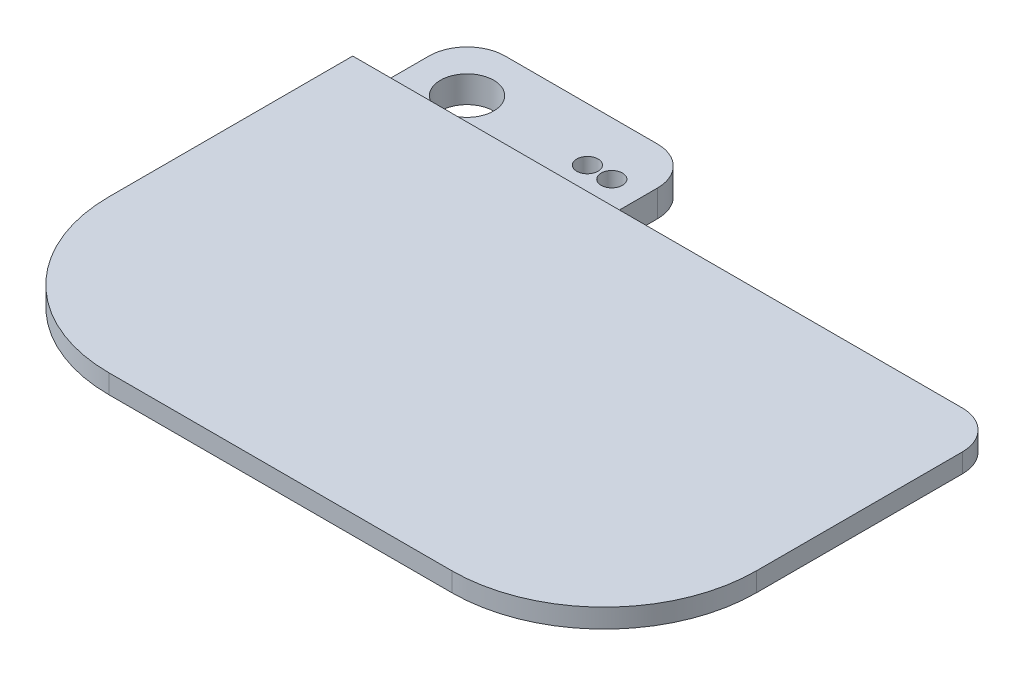
ISO-10303-21;
HEADER;
FILE_DESCRIPTION(('STEP AP214'),'2;1');
FILE_NAME('part.step','',(''),(''),'','','');
FILE_SCHEMA(('AUTOMOTIVE_DESIGN { 1 0 10303 214 1 1 1 1 }'));
ENDSEC;
DATA;
#1=APPLICATION_CONTEXT('core data for automotive mechanical design processes');
#2=APPLICATION_PROTOCOL_DEFINITION('international standard','automotive_design',2000,#1);
#3=PRODUCT_CONTEXT('',#1,'mechanical');
#4=PRODUCT('Part','Part','',(#3));
#5=PRODUCT_RELATED_PRODUCT_CATEGORY('part','',(#4));
#6=PRODUCT_DEFINITION_FORMATION('','',#4);
#7=PRODUCT_DEFINITION_CONTEXT('part definition',#1,'design');
#8=PRODUCT_DEFINITION('design','',#6,#7);
#9=PRODUCT_DEFINITION_SHAPE('','',#8);
#10=(LENGTH_UNIT() NAMED_UNIT(*) SI_UNIT(.MILLI.,.METRE.));
#11=(NAMED_UNIT(*) PLANE_ANGLE_UNIT() SI_UNIT($,.RADIAN.));
#12=(NAMED_UNIT(*) SI_UNIT($,.STERADIAN.) SOLID_ANGLE_UNIT());
#13=UNCERTAINTY_MEASURE_WITH_UNIT(LENGTH_MEASURE(1.E-05),#10,'distance_accuracy_value','');
#14=(GEOMETRIC_REPRESENTATION_CONTEXT(3) GLOBAL_UNCERTAINTY_ASSIGNED_CONTEXT((#13)) GLOBAL_UNIT_ASSIGNED_CONTEXT((#10,
#11,#12)) REPRESENTATION_CONTEXT('',''));
#15=CARTESIAN_POINT('',(0.,0.,0.));
#16=DIRECTION('',(0.,0.,1.));
#17=DIRECTION('',(1.,0.,0.));
#18=AXIS2_PLACEMENT_3D('',#15,#16,#17);
#19=CARTESIAN_POINT('',(107.95,3.175,-66.04));
#20=DIRECTION('',(0.,0.,1.));
#21=DIRECTION('',(1.,0.,0.));
#22=AXIS2_PLACEMENT_3D('',#19,#20,#21);
#23=PLANE('',#22);
#24=DIRECTION('',(0.,-1.,0.));
#25=VECTOR('',#24,1.);
#26=CARTESIAN_POINT('',(88.9,3.175,-66.04));
#27=LINE('',#26,#25);
#28=CARTESIAN_POINT('',(88.9,-3.175,-66.04));
#29=VERTEX_POINT('',#28);
#30=CARTESIAN_POINT('',(88.9,-4.445,-66.04));
#31=VERTEX_POINT('',#30);
#32=EDGE_CURVE('E250',#29,#31,#27,.T.);
#33=ORIENTED_EDGE('',*,*,#32,.T.);
#34=CARTESIAN_POINT('',(85.725,-4.445,-66.04));
#35=DIRECTION('',(0.,0.,1.));
#36=DIRECTION('',(1.,0.,0.));
#37=AXIS2_PLACEMENT_3D('',#34,#35,#36);
#38=CIRCLE('',#37,3.175);
#39=CARTESIAN_POINT('',(85.725,-7.62,-66.04));
#40=VERTEX_POINT('',#39);
#41=EDGE_CURVE('E55',#31,#40,#38,.F.);
#42=ORIENTED_EDGE('',*,*,#41,.T.);
#43=DIRECTION('',(-1.,0.,0.));
#44=VECTOR('',#43,1.);
#45=CARTESIAN_POINT('',(107.95,-7.62,-66.04));
#46=LINE('',#45,#44);
#47=CARTESIAN_POINT('',(38.1,-7.62,-66.04));
#48=VERTEX_POINT('',#47);
#49=EDGE_CURVE('E205',#40,#48,#46,.T.);
#50=ORIENTED_EDGE('',*,*,#49,.T.);
#51=DIRECTION('',(0.,-1.,0.));
#52=VECTOR('',#51,1.);
#53=CARTESIAN_POINT('',(38.1,3.175,-66.04));
#54=LINE('',#53,#52);
#55=CARTESIAN_POINT('',(38.1,3.175,-66.04));
#56=VERTEX_POINT('',#55);
#57=EDGE_CURVE('E208',#56,#48,#54,.T.);
#58=ORIENTED_EDGE('',*,*,#57,.F.);
#59=DIRECTION('',(-1.,0.,0.));
#60=VECTOR('',#59,1.);
#61=CARTESIAN_POINT('',(107.95,3.175,-66.04));
#62=LINE('',#61,#60);
#63=CARTESIAN_POINT('',(101.6,3.175,-66.04));
#64=VERTEX_POINT('',#63);
#65=EDGE_CURVE('E206',#64,#56,#62,.T.);
#66=ORIENTED_EDGE('',*,*,#65,.F.);
#67=DIRECTION('',(0.,-1.,0.));
#68=VECTOR('',#67,1.);
#69=CARTESIAN_POINT('',(101.6,3.175,-66.04));
#70=LINE('',#69,#68);
#71=CARTESIAN_POINT('',(101.6,0.,-66.04));
#72=VERTEX_POINT('',#71);
#73=EDGE_CURVE('E287',#64,#72,#70,.T.);
#74=ORIENTED_EDGE('',*,*,#73,.T.);
#75=DIRECTION('',(-1.,0.,0.));
#76=VECTOR('',#75,1.);
#77=CARTESIAN_POINT('',(107.95,0.,-66.04));
#78=LINE('',#77,#76);
#79=CARTESIAN_POINT('',(92.075,0.,-66.04));
#80=VERTEX_POINT('',#79);
#81=EDGE_CURVE('E240',#72,#80,#78,.T.);
#82=ORIENTED_EDGE('',*,*,#81,.T.);
#83=CARTESIAN_POINT('',(92.075,-3.175,-66.04));
#84=DIRECTION('',(0.,0.,1.));
#85=DIRECTION('',(1.,0.,0.));
#86=AXIS2_PLACEMENT_3D('',#83,#84,#85);
#87=CIRCLE('',#86,3.175);
#88=EDGE_CURVE('E11',#80,#29,#87,.T.);
#89=ORIENTED_EDGE('',*,*,#88,.T.);
#90=EDGE_LOOP('',(#33,#42,#50,#58,#66,#74,#82,#89));
#91=FACE_BOUND('',#90,.T.);
#92=ADVANCED_FACE('F32',(#91),#23,.F.);
#93=CARTESIAN_POINT('',(0.,3.175,-85.09));
#94=DIRECTION('',(0.,0.,1.));
#95=DIRECTION('',(1.,0.,0.));
#96=AXIS2_PLACEMENT_3D('',#93,#94,#95);
#97=PLANE('',#96);
#98=DIRECTION('',(1.,0.,0.));
#99=VECTOR('',#98,1.);
#100=CARTESIAN_POINT('',(0.,-7.62,-85.09));
#101=LINE('',#100,#99);
#102=CARTESIAN_POINT('',(6.35,-7.62,-85.09));
#103=VERTEX_POINT('',#102);
#104=CARTESIAN_POINT('',(31.75,-7.62,-85.09));
#105=VERTEX_POINT('',#104);
#106=EDGE_CURVE('E220',#103,#105,#101,.T.);
#107=ORIENTED_EDGE('',*,*,#106,.F.);
#108=DIRECTION('',(0.,-1.,0.));
#109=VECTOR('',#108,1.);
#110=CARTESIAN_POINT('',(6.35,3.175,-85.09));
#111=LINE('',#110,#109);
#112=CARTESIAN_POINT('',(6.35000000000002,-3.175,-85.09));
#113=VERTEX_POINT('',#112);
#114=EDGE_CURVE('E280',#103,#113,#111,.F.);
#115=ORIENTED_EDGE('',*,*,#114,.T.);
#116=DIRECTION('',(-1.,0.,0.));
#117=VECTOR('',#116,1.);
#118=CARTESIAN_POINT('',(38.1,-3.175,-85.09));
#119=LINE('',#118,#117);
#120=CARTESIAN_POINT('',(31.75,-3.175,-85.09));
#121=VERTEX_POINT('',#120);
#122=EDGE_CURVE('E167',#121,#113,#119,.T.);
#123=ORIENTED_EDGE('',*,*,#122,.F.);
#124=DIRECTION('',(0.,-1.,0.));
#125=VECTOR('',#124,1.);
#126=CARTESIAN_POINT('',(31.75,3.175,-85.09));
#127=LINE('',#126,#125);
#128=EDGE_CURVE('E277',#121,#105,#127,.T.);
#129=ORIENTED_EDGE('',*,*,#128,.T.);
#130=EDGE_LOOP('',(#107,#115,#123,#129));
#131=FACE_BOUND('',#130,.T.);
#132=ADVANCED_FACE('F369',(#131),#97,.F.);
#133=CARTESIAN_POINT('',(8.89,3.175,-76.2));
#134=DIRECTION('',(0.,-1.,0.));
#135=DIRECTION('',(0.,0.,-1.));
#136=AXIS2_PLACEMENT_3D('',#133,#134,#135);
#137=CYLINDRICAL_SURFACE('',#136,4.445);
#138=CARTESIAN_POINT('',(8.89,-7.62,-76.2));
#139=DIRECTION('',(0.,-1.,0.));
#140=DIRECTION('',(0.,0.,-1.));
#141=AXIS2_PLACEMENT_3D('',#138,#139,#140);
#142=CIRCLE('',#141,4.445);
#143=CARTESIAN_POINT('',(8.89,-7.62,-80.645));
#144=VERTEX_POINT('',#143);
#145=EDGE_CURVE('E213',#144,#144,#142,.T.);
#146=ORIENTED_EDGE('',*,*,#145,.T.);
#147=EDGE_LOOP('',(#146));
#148=FACE_BOUND('',#147,.T.);
#149=CARTESIAN_POINT('',(8.89,-3.175,-76.2));
#150=DIRECTION('',(0.,1.,0.));
#151=DIRECTION('',(0.,0.,1.));
#152=AXIS2_PLACEMENT_3D('',#149,#150,#151);
#153=CIRCLE('',#152,4.445);
#154=CARTESIAN_POINT('',(8.89,-3.175,-71.755));
#155=VERTEX_POINT('',#154);
#156=EDGE_CURVE('E202',#155,#155,#153,.T.);
#157=ORIENTED_EDGE('',*,*,#156,.T.);
#158=EDGE_LOOP('',(#157));
#159=FACE_BOUND('',#158,.T.);
#160=ADVANCED_FACE('F374',(#148,#159),#137,.F.);
#161=CARTESIAN_POINT('',(38.1,3.175,-85.09));
#162=DIRECTION('',(-1.,0.,0.));
#163=DIRECTION('',(0.,0.,1.));
#164=AXIS2_PLACEMENT_3D('',#161,#162,#163);
#165=PLANE('',#164);
#166=DIRECTION('',(0.,0.,-1.));
#167=VECTOR('',#166,1.);
#168=CARTESIAN_POINT('',(38.1,-7.62,-85.09));
#169=LINE('',#168,#167);
#170=CARTESIAN_POINT('',(38.1,-7.62,-78.74));
#171=VERTEX_POINT('',#170);
#172=EDGE_CURVE('E209',#48,#171,#169,.T.);
#173=ORIENTED_EDGE('',*,*,#172,.T.);
#174=DIRECTION('',(0.,-1.,0.));
#175=VECTOR('',#174,1.);
#176=CARTESIAN_POINT('',(38.1,3.175,-78.74));
#177=LINE('',#176,#175);
#178=CARTESIAN_POINT('',(38.1,-3.175,-78.74));
#179=VERTEX_POINT('',#178);
#180=EDGE_CURVE('E164',#171,#179,#177,.F.);
#181=ORIENTED_EDGE('',*,*,#180,.T.);
#182=DIRECTION('',(0.,0.,-1.));
#183=VECTOR('',#182,1.);
#184=CARTESIAN_POINT('',(38.1,-3.175,-66.04));
#185=LINE('',#184,#183);
#186=CARTESIAN_POINT('',(38.1,-3.175,-71.12));
#187=VERTEX_POINT('',#186);
#188=EDGE_CURVE('E155',#187,#179,#185,.T.);
#189=ORIENTED_EDGE('',*,*,#188,.F.);
#190=DIRECTION('',(0.,0.78086880944303,0.624695047554424));
#191=VECTOR('',#190,1.);
#192=CARTESIAN_POINT('',(38.1,3.175,-66.04));
#193=LINE('',#192,#191);
#194=EDGE_CURVE('E161',#187,#56,#193,.T.);
#195=ORIENTED_EDGE('',*,*,#194,.T.);
#196=ORIENTED_EDGE('',*,*,#57,.T.);
#197=EDGE_LOOP('',(#173,#181,#189,#195,#196));
#198=FACE_BOUND('',#197,.T.);
#199=ADVANCED_FACE('F158',(#198),#165,.F.);
#200=CARTESIAN_POINT('',(0.,3.175,0.));
#201=DIRECTION('',(0.,-1.,0.));
#202=DIRECTION('',(0.,0.,-1.));
#203=AXIS2_PLACEMENT_3D('',#200,#201,#202);
#204=PLANE('',#203);
#205=DIRECTION('',(0.,0.,-1.));
#206=VECTOR('',#205,1.);
#207=CARTESIAN_POINT('',(107.95,3.175,0.));
#208=LINE('',#207,#206);
#209=CARTESIAN_POINT('',(107.95,3.175,-25.4));
#210=VERTEX_POINT('',#209);
#211=CARTESIAN_POINT('',(107.95,3.175,-59.69));
#212=VERTEX_POINT('',#211);
#213=EDGE_CURVE('E237',#210,#212,#208,.T.);
#214=ORIENTED_EDGE('',*,*,#213,.T.);
#215=CARTESIAN_POINT('',(101.6,3.175,-59.69));
#216=DIRECTION('',(0.,-1.,0.));
#217=DIRECTION('',(0.,0.,-1.));
#218=AXIS2_PLACEMENT_3D('',#215,#216,#217);
#219=CIRCLE('',#218,6.35);
#220=EDGE_CURVE('E294',#212,#64,#219,.F.);
#221=ORIENTED_EDGE('',*,*,#220,.T.);
#222=ORIENTED_EDGE('',*,*,#65,.T.);
#223=DIRECTION('',(-1.,0.,0.));
#224=VECTOR('',#223,1.);
#225=CARTESIAN_POINT('',(46.2319677815397,3.175,-66.04));
#226=LINE('',#225,#224);
#227=CARTESIAN_POINT('',(0.,3.175,-66.04));
#228=VERTEX_POINT('',#227);
#229=EDGE_CURVE('E180',#56,#228,#226,.T.);
#230=ORIENTED_EDGE('',*,*,#229,.T.);
#231=DIRECTION('',(0.,0.,1.));
#232=VECTOR('',#231,1.);
#233=CARTESIAN_POINT('',(0.,3.175,0.));
#234=LINE('',#233,#232);
#235=CARTESIAN_POINT('',(0.,3.175,-25.4));
#236=VERTEX_POINT('',#235);
#237=EDGE_CURVE('E230',#228,#236,#234,.T.);
#238=ORIENTED_EDGE('',*,*,#237,.T.);
#239=CARTESIAN_POINT('',(25.4,3.175,-25.4));
#240=DIRECTION('',(0.,-1.,0.));
#241=DIRECTION('',(0.,0.,-1.));
#242=AXIS2_PLACEMENT_3D('',#239,#240,#241);
#243=CIRCLE('',#242,25.4);
#244=CARTESIAN_POINT('',(25.4,3.175,0.));
#245=VERTEX_POINT('',#244);
#246=EDGE_CURVE('E265',#236,#245,#243,.F.);
#247=ORIENTED_EDGE('',*,*,#246,.T.);
#248=DIRECTION('',(1.,0.,0.));
#249=VECTOR('',#248,1.);
#250=CARTESIAN_POINT('',(0.,3.175,0.));
#251=LINE('',#250,#249);
#252=CARTESIAN_POINT('',(82.55,3.175,0.));
#253=VERTEX_POINT('',#252);
#254=EDGE_CURVE('E233',#245,#253,#251,.T.);
#255=ORIENTED_EDGE('',*,*,#254,.T.);
#256=CARTESIAN_POINT('',(82.55,3.175,-25.4));
#257=DIRECTION('',(0.,-1.,0.));
#258=DIRECTION('',(0.,0.,-1.));
#259=AXIS2_PLACEMENT_3D('',#256,#257,#258);
#260=CIRCLE('',#259,25.4);
#261=EDGE_CURVE('E263',#253,#210,#260,.F.);
#262=ORIENTED_EDGE('',*,*,#261,.T.);
#263=EDGE_LOOP('',(#214,#221,#222,#230,#238,#247,#255,#262));
#264=FACE_BOUND('',#263,.T.);
#265=ADVANCED_FACE('F388',(#264),#204,.F.);
#266=CARTESIAN_POINT('',(0.,0.,0.));
#267=DIRECTION('',(0.,-1.,0.));
#268=DIRECTION('',(0.,0.,-1.));
#269=AXIS2_PLACEMENT_3D('',#266,#267,#268);
#270=PLANE('',#269);
#271=DIRECTION('',(-1.,0.,0.));
#272=VECTOR('',#271,1.);
#273=CARTESIAN_POINT('',(0.,0.,-59.69));
#274=LINE('',#273,#272);
#275=CARTESIAN_POINT('',(92.075,0.,-59.69));
#276=VERTEX_POINT('',#275);
#277=CARTESIAN_POINT('',(0.,0.,-59.69));
#278=VERTEX_POINT('',#277);
#279=EDGE_CURVE('E216',#276,#278,#274,.T.);
#280=ORIENTED_EDGE('',*,*,#279,.F.);
#281=DIRECTION('',(0.,0.,1.));
#282=VECTOR('',#281,1.);
#283=CARTESIAN_POINT('',(92.075,0.,0.));
#284=LINE('',#283,#282);
#285=EDGE_CURVE('E301',#276,#80,#284,.F.);
#286=ORIENTED_EDGE('',*,*,#285,.T.);
#287=ORIENTED_EDGE('',*,*,#81,.F.);
#288=CARTESIAN_POINT('',(101.6,0.,-59.69));
#289=DIRECTION('',(0.,-1.,0.));
#290=DIRECTION('',(0.,0.,-1.));
#291=AXIS2_PLACEMENT_3D('',#288,#289,#290);
#292=CIRCLE('',#291,6.35);
#293=CARTESIAN_POINT('',(107.95,0.,-59.69));
#294=VERTEX_POINT('',#293);
#295=EDGE_CURVE('E290',#72,#294,#292,.T.);
#296=ORIENTED_EDGE('',*,*,#295,.T.);
#297=DIRECTION('',(0.,0.,-1.));
#298=VECTOR('',#297,1.);
#299=CARTESIAN_POINT('',(107.95,0.,0.));
#300=LINE('',#299,#298);
#301=CARTESIAN_POINT('',(107.95,0.,-25.4));
#302=VERTEX_POINT('',#301);
#303=EDGE_CURVE('E234',#302,#294,#300,.T.);
#304=ORIENTED_EDGE('',*,*,#303,.F.);
#305=CARTESIAN_POINT('',(82.55,0.,-25.4));
#306=DIRECTION('',(0.,-1.,0.));
#307=DIRECTION('',(0.,0.,-1.));
#308=AXIS2_PLACEMENT_3D('',#305,#306,#307);
#309=CIRCLE('',#308,25.4);
#310=CARTESIAN_POINT('',(82.55,0.,0.));
#311=VERTEX_POINT('',#310);
#312=EDGE_CURVE('E257',#302,#311,#309,.T.);
#313=ORIENTED_EDGE('',*,*,#312,.T.);
#314=DIRECTION('',(1.,0.,0.));
#315=VECTOR('',#314,1.);
#316=CARTESIAN_POINT('',(0.,0.,0.));
#317=LINE('',#316,#315);
#318=CARTESIAN_POINT('',(25.4,0.,0.));
#319=VERTEX_POINT('',#318);
#320=EDGE_CURVE('E243',#319,#311,#317,.T.);
#321=ORIENTED_EDGE('',*,*,#320,.F.);
#322=CARTESIAN_POINT('',(25.4,0.,-25.4));
#323=DIRECTION('',(0.,-1.,0.));
#324=DIRECTION('',(0.,0.,-1.));
#325=AXIS2_PLACEMENT_3D('',#322,#323,#324);
#326=CIRCLE('',#325,25.4);
#327=CARTESIAN_POINT('',(0.,0.,-25.4));
#328=VERTEX_POINT('',#327);
#329=EDGE_CURVE('E259',#319,#328,#326,.T.);
#330=ORIENTED_EDGE('',*,*,#329,.T.);
#331=DIRECTION('',(0.,0.,1.));
#332=VECTOR('',#331,1.);
#333=CARTESIAN_POINT('',(0.,0.,0.));
#334=LINE('',#333,#332);
#335=EDGE_CURVE('E229',#278,#328,#334,.T.);
#336=ORIENTED_EDGE('',*,*,#335,.F.);
#337=EDGE_LOOP('',(#280,#286,#287,#296,#304,#313,#321,#330,#336));
#338=FACE_BOUND('',#337,.T.);
#339=ADVANCED_FACE('F320',(#338),#270,.T.);
#340=CARTESIAN_POINT('',(0.,3.175,0.));
#341=DIRECTION('',(1.,0.,0.));
#342=DIRECTION('',(0.,0.,-1.));
#343=AXIS2_PLACEMENT_3D('',#340,#341,#342);
#344=PLANE('',#343);
#345=DIRECTION('',(0.,0.,1.));
#346=VECTOR('',#345,1.);
#347=CARTESIAN_POINT('',(0.,-3.175,-66.04));
#348=LINE('',#347,#346);
#349=CARTESIAN_POINT('',(0.,-3.175,-78.74));
#350=VERTEX_POINT('',#349);
#351=CARTESIAN_POINT('',(0.,-3.175,-71.12));
#352=VERTEX_POINT('',#351);
#353=EDGE_CURVE('E176',#350,#352,#348,.T.);
#354=ORIENTED_EDGE('',*,*,#353,.F.);
#355=DIRECTION('',(0.,-1.,0.));
#356=VECTOR('',#355,1.);
#357=CARTESIAN_POINT('',(0.,3.175,-78.74));
#358=LINE('',#357,#356);
#359=CARTESIAN_POINT('',(0.,-7.62,-78.74));
#360=VERTEX_POINT('',#359);
#361=EDGE_CURVE('E270',#350,#360,#358,.T.);
#362=ORIENTED_EDGE('',*,*,#361,.T.);
#363=DIRECTION('',(0.,0.,-1.));
#364=VECTOR('',#363,1.);
#365=CARTESIAN_POINT('',(0.,-7.62,-85.09));
#366=LINE('',#365,#364);
#367=CARTESIAN_POINT('',(0.,-7.62,-59.69));
#368=VERTEX_POINT('',#367);
#369=EDGE_CURVE('E217',#368,#360,#366,.T.);
#370=ORIENTED_EDGE('',*,*,#369,.F.);
#371=DIRECTION('',(0.,1.,0.));
#372=VECTOR('',#371,1.);
#373=CARTESIAN_POINT('',(0.,-7.62,-59.69));
#374=LINE('',#373,#372);
#375=EDGE_CURVE('E225',#368,#278,#374,.T.);
#376=ORIENTED_EDGE('',*,*,#375,.T.);
#377=ORIENTED_EDGE('',*,*,#335,.T.);
#378=DIRECTION('',(0.,-1.,0.));
#379=VECTOR('',#378,1.);
#380=CARTESIAN_POINT('',(0.,3.175,-25.4));
#381=LINE('',#380,#379);
#382=EDGE_CURVE('E261',#328,#236,#381,.F.);
#383=ORIENTED_EDGE('',*,*,#382,.T.);
#384=ORIENTED_EDGE('',*,*,#237,.F.);
#385=DIRECTION('',(0.,-0.78086880944303,-0.624695047554424));
#386=VECTOR('',#385,1.);
#387=CARTESIAN_POINT('',(0.,3.175,-66.04));
#388=LINE('',#387,#386);
#389=EDGE_CURVE('E592',#228,#352,#388,.T.);
#390=ORIENTED_EDGE('',*,*,#389,.T.);
#391=EDGE_LOOP('',(#354,#362,#370,#376,#377,#383,#384,#390));
#392=FACE_BOUND('',#391,.T.);
#393=ADVANCED_FACE('F348',(#392),#344,.F.);
#394=CARTESIAN_POINT('',(0.,3.175,0.));
#395=DIRECTION('',(0.,0.,-1.));
#396=DIRECTION('',(-1.,0.,0.));
#397=AXIS2_PLACEMENT_3D('',#394,#395,#396);
#398=PLANE('',#397);
#399=ORIENTED_EDGE('',*,*,#254,.F.);
#400=DIRECTION('',(0.,-1.,0.));
#401=VECTOR('',#400,1.);
#402=CARTESIAN_POINT('',(25.4,3.175,0.));
#403=LINE('',#402,#401);
#404=EDGE_CURVE('E254',#245,#319,#403,.T.);
#405=ORIENTED_EDGE('',*,*,#404,.T.);
#406=ORIENTED_EDGE('',*,*,#320,.T.);
#407=DIRECTION('',(0.,-1.,0.));
#408=VECTOR('',#407,1.);
#409=CARTESIAN_POINT('',(82.55,3.175,0.));
#410=LINE('',#409,#408);
#411=EDGE_CURVE('E252',#311,#253,#410,.F.);
#412=ORIENTED_EDGE('',*,*,#411,.T.);
#413=EDGE_LOOP('',(#399,#405,#406,#412));
#414=FACE_BOUND('',#413,.T.);
#415=ADVANCED_FACE('F341',(#414),#398,.F.);
#416=CARTESIAN_POINT('',(107.95,3.175,0.));
#417=DIRECTION('',(-1.,0.,0.));
#418=DIRECTION('',(0.,0.,1.));
#419=AXIS2_PLACEMENT_3D('',#416,#417,#418);
#420=PLANE('',#419);
#421=ORIENTED_EDGE('',*,*,#303,.T.);
#422=DIRECTION('',(0.,-1.,0.));
#423=VECTOR('',#422,1.);
#424=CARTESIAN_POINT('',(107.95,3.175,-59.69));
#425=LINE('',#424,#423);
#426=EDGE_CURVE('E292',#294,#212,#425,.F.);
#427=ORIENTED_EDGE('',*,*,#426,.T.);
#428=ORIENTED_EDGE('',*,*,#213,.F.);
#429=DIRECTION('',(0.,-1.,0.));
#430=VECTOR('',#429,1.);
#431=CARTESIAN_POINT('',(107.95,3.175,-25.4));
#432=LINE('',#431,#430);
#433=EDGE_CURVE('E267',#210,#302,#432,.T.);
#434=ORIENTED_EDGE('',*,*,#433,.T.);
#435=EDGE_LOOP('',(#421,#427,#428,#434));
#436=FACE_BOUND('',#435,.T.);
#437=ADVANCED_FACE('F331',(#436),#420,.F.);
#438=CARTESIAN_POINT('',(0.,-7.62,0.));
#439=DIRECTION('',(0.,1.,0.));
#440=DIRECTION('',(0.,0.,1.));
#441=AXIS2_PLACEMENT_3D('',#438,#439,#440);
#442=PLANE('',#441);
#443=CARTESIAN_POINT('',(28.956,-7.62,-76.2));
#444=DIRECTION('',(0.,1.,0.));
#445=DIRECTION('',(0.,0.,1.));
#446=AXIS2_PLACEMENT_3D('',#443,#444,#445);
#447=CIRCLE('',#446,1.778);
#448=CARTESIAN_POINT('',(28.956,-7.62,-74.422));
#449=VERTEX_POINT('',#448);
#450=EDGE_CURVE('E168',#449,#449,#447,.T.);
#451=ORIENTED_EDGE('',*,*,#450,.T.);
#452=EDGE_LOOP('',(#451));
#453=FACE_BOUND('',#452,.T.);
#454=CARTESIAN_POINT('',(33.02,-7.62,-76.2));
#455=DIRECTION('',(0.,1.,0.));
#456=DIRECTION('',(0.,0.,1.));
#457=AXIS2_PLACEMENT_3D('',#454,#455,#456);
#458=CIRCLE('',#457,1.778);
#459=CARTESIAN_POINT('',(33.02,-7.62,-74.422));
#460=VERTEX_POINT('',#459);
#461=EDGE_CURVE('E195',#460,#460,#458,.T.);
#462=ORIENTED_EDGE('',*,*,#461,.T.);
#463=EDGE_LOOP('',(#462));
#464=FACE_BOUND('',#463,.T.);
#465=ORIENTED_EDGE('',*,*,#49,.F.);
#466=DIRECTION('',(0.,0.,1.));
#467=VECTOR('',#466,1.);
#468=CARTESIAN_POINT('',(85.725,-7.62,0.));
#469=LINE('',#468,#467);
#470=CARTESIAN_POINT('',(85.725,-7.62,-59.69));
#471=VERTEX_POINT('',#470);
#472=EDGE_CURVE('E303',#40,#471,#469,.T.);
#473=ORIENTED_EDGE('',*,*,#472,.T.);
#474=DIRECTION('',(-1.,0.,0.));
#475=VECTOR('',#474,1.);
#476=CARTESIAN_POINT('',(0.,-7.62,-59.69));
#477=LINE('',#476,#475);
#478=EDGE_CURVE('E223',#471,#368,#477,.T.);
#479=ORIENTED_EDGE('',*,*,#478,.T.);
#480=ORIENTED_EDGE('',*,*,#369,.T.);
#481=CARTESIAN_POINT('',(6.35,-7.62,-78.74));
#482=DIRECTION('',(0.,1.,0.));
#483=DIRECTION('',(0.,0.,1.));
#484=AXIS2_PLACEMENT_3D('',#481,#482,#483);
#485=CIRCLE('',#484,6.35);
#486=EDGE_CURVE('E275',#360,#103,#485,.F.);
#487=ORIENTED_EDGE('',*,*,#486,.T.);
#488=ORIENTED_EDGE('',*,*,#106,.T.);
#489=CARTESIAN_POINT('',(31.75,-7.62,-78.74));
#490=DIRECTION('',(0.,1.,0.));
#491=DIRECTION('',(0.,0.,1.));
#492=AXIS2_PLACEMENT_3D('',#489,#490,#491);
#493=CIRCLE('',#492,6.35);
#494=EDGE_CURVE('E273',#105,#171,#493,.F.);
#495=ORIENTED_EDGE('',*,*,#494,.T.);
#496=ORIENTED_EDGE('',*,*,#172,.F.);
#497=EDGE_LOOP('',(#465,#473,#479,#480,#487,#488,#495,#496));
#498=FACE_BOUND('',#497,.T.);
#499=ORIENTED_EDGE('',*,*,#145,.F.);
#500=EDGE_LOOP('',(#499));
#501=FACE_BOUND('',#500,.T.);
#502=ADVANCED_FACE('F352',(#453,#464,#498,#501),#442,.F.);
#503=CARTESIAN_POINT('',(0.,-7.62,-59.69));
#504=DIRECTION('',(0.,0.,-1.));
#505=DIRECTION('',(-1.,0.,0.));
#506=AXIS2_PLACEMENT_3D('',#503,#504,#505);
#507=PLANE('',#506);
#508=ORIENTED_EDGE('',*,*,#478,.F.);
#509=CARTESIAN_POINT('',(85.725,-4.445,-59.69));
#510=DIRECTION('',(0.,0.,-1.));
#511=DIRECTION('',(-1.,0.,0.));
#512=AXIS2_PLACEMENT_3D('',#509,#510,#511);
#513=CIRCLE('',#512,3.175);
#514=CARTESIAN_POINT('',(88.9,-4.445,-59.69));
#515=VERTEX_POINT('',#514);
#516=EDGE_CURVE('E47',#471,#515,#513,.F.);
#517=ORIENTED_EDGE('',*,*,#516,.T.);
#518=DIRECTION('',(0.,-1.,0.));
#519=VECTOR('',#518,1.);
#520=CARTESIAN_POINT('',(88.9,0.,-59.69));
#521=LINE('',#520,#519);
#522=CARTESIAN_POINT('',(88.9,-3.175,-59.69));
#523=VERTEX_POINT('',#522);
#524=EDGE_CURVE('E183',#523,#515,#521,.T.);
#525=ORIENTED_EDGE('',*,*,#524,.F.);
#526=CARTESIAN_POINT('',(92.075,-3.175,-59.69));
#527=DIRECTION('',(0.,0.,-1.));
#528=DIRECTION('',(-1.,0.,0.));
#529=AXIS2_PLACEMENT_3D('',#526,#527,#528);
#530=CIRCLE('',#529,3.175);
#531=EDGE_CURVE('E40',#523,#276,#530,.T.);
#532=ORIENTED_EDGE('',*,*,#531,.T.);
#533=ORIENTED_EDGE('',*,*,#279,.T.);
#534=ORIENTED_EDGE('',*,*,#375,.F.);
#535=EDGE_LOOP('',(#508,#517,#525,#532,#533,#534));
#536=FACE_BOUND('',#535,.T.);
#537=ADVANCED_FACE('F311',(#536),#507,.F.);
#538=CARTESIAN_POINT('',(0.,-3.175,0.));
#539=DIRECTION('',(0.,1.,0.));
#540=DIRECTION('',(0.,0.,1.));
#541=AXIS2_PLACEMENT_3D('',#538,#539,#540);
#542=PLANE('',#541);
#543=ORIENTED_EDGE('',*,*,#122,.T.);
#544=CARTESIAN_POINT('',(6.35,-3.175,-78.74));
#545=DIRECTION('',(0.,1.,0.));
#546=DIRECTION('',(0.,0.,1.));
#547=AXIS2_PLACEMENT_3D('',#544,#545,#546);
#548=CIRCLE('',#547,6.35);
#549=EDGE_CURVE('E284',#113,#350,#548,.T.);
#550=ORIENTED_EDGE('',*,*,#549,.T.);
#551=ORIENTED_EDGE('',*,*,#353,.T.);
#552=DIRECTION('',(-1.,0.,0.));
#553=VECTOR('',#552,1.);
#554=CARTESIAN_POINT('',(46.2319677815397,-3.175,-71.12));
#555=LINE('',#554,#553);
#556=EDGE_CURVE('E171',#187,#352,#555,.T.);
#557=ORIENTED_EDGE('',*,*,#556,.F.);
#558=ORIENTED_EDGE('',*,*,#188,.T.);
#559=CARTESIAN_POINT('',(31.75,-3.175,-78.74));
#560=DIRECTION('',(0.,1.,0.));
#561=DIRECTION('',(0.,0.,1.));
#562=AXIS2_PLACEMENT_3D('',#559,#560,#561);
#563=CIRCLE('',#562,6.35);
#564=EDGE_CURVE('E282',#179,#121,#563,.T.);
#565=ORIENTED_EDGE('',*,*,#564,.T.);
#566=EDGE_LOOP('',(#543,#550,#551,#557,#558,#565));
#567=FACE_BOUND('',#566,.T.);
#568=CARTESIAN_POINT('',(28.956,-3.175,-76.2));
#569=DIRECTION('',(0.,1.,0.));
#570=DIRECTION('',(0.,0.,1.));
#571=AXIS2_PLACEMENT_3D('',#568,#569,#570);
#572=CIRCLE('',#571,1.778);
#573=CARTESIAN_POINT('',(28.956,-3.175,-74.422));
#574=VERTEX_POINT('',#573);
#575=EDGE_CURVE('E192',#574,#574,#572,.T.);
#576=ORIENTED_EDGE('',*,*,#575,.F.);
#577=EDGE_LOOP('',(#576));
#578=FACE_BOUND('',#577,.T.);
#579=CARTESIAN_POINT('',(33.02,-3.175,-76.2));
#580=DIRECTION('',(0.,1.,0.));
#581=DIRECTION('',(0.,0.,1.));
#582=AXIS2_PLACEMENT_3D('',#579,#580,#581);
#583=CIRCLE('',#582,1.778);
#584=CARTESIAN_POINT('',(33.02,-3.175,-74.422));
#585=VERTEX_POINT('',#584);
#586=EDGE_CURVE('E186',#585,#585,#583,.T.);
#587=ORIENTED_EDGE('',*,*,#586,.F.);
#588=EDGE_LOOP('',(#587));
#589=FACE_BOUND('',#588,.T.);
#590=ORIENTED_EDGE('',*,*,#156,.F.);
#591=EDGE_LOOP('',(#590));
#592=FACE_BOUND('',#591,.T.);
#593=ADVANCED_FACE('F173',(#567,#578,#589,#592),#542,.T.);
#594=CARTESIAN_POINT('',(33.02,-7.62,-76.2));
#595=DIRECTION('',(0.,1.,0.));
#596=DIRECTION('',(0.,0.,1.));
#597=AXIS2_PLACEMENT_3D('',#594,#595,#596);
#598=CYLINDRICAL_SURFACE('',#597,1.778);
#599=ORIENTED_EDGE('',*,*,#461,.F.);
#600=EDGE_LOOP('',(#599));
#601=FACE_BOUND('',#600,.T.);
#602=ORIENTED_EDGE('',*,*,#586,.T.);
#603=EDGE_LOOP('',(#602));
#604=FACE_BOUND('',#603,.T.);
#605=ADVANCED_FACE('F365',(#601,#604),#598,.F.);
#606=CARTESIAN_POINT('',(28.956,-7.62,-76.2));
#607=DIRECTION('',(0.,1.,0.));
#608=DIRECTION('',(0.,0.,1.));
#609=AXIS2_PLACEMENT_3D('',#606,#607,#608);
#610=CYLINDRICAL_SURFACE('',#609,1.778);
#611=ORIENTED_EDGE('',*,*,#450,.F.);
#612=EDGE_LOOP('',(#611));
#613=FACE_BOUND('',#612,.T.);
#614=ORIENTED_EDGE('',*,*,#575,.T.);
#615=EDGE_LOOP('',(#614));
#616=FACE_BOUND('',#615,.T.);
#617=ADVANCED_FACE('F358',(#613,#616),#610,.F.);
#618=CARTESIAN_POINT('',(88.9,0.,-85.09));
#619=DIRECTION('',(-1.,0.,0.));
#620=DIRECTION('',(0.,0.,1.));
#621=AXIS2_PLACEMENT_3D('',#618,#619,#620);
#622=PLANE('',#621);
#623=ORIENTED_EDGE('',*,*,#32,.F.);
#624=DIRECTION('',(0.,0.,1.));
#625=VECTOR('',#624,1.);
#626=CARTESIAN_POINT('',(88.9,-3.175,-85.09));
#627=LINE('',#626,#625);
#628=EDGE_CURVE('E298',#29,#523,#627,.T.);
#629=ORIENTED_EDGE('',*,*,#628,.T.);
#630=ORIENTED_EDGE('',*,*,#524,.T.);
#631=DIRECTION('',(0.,0.,1.));
#632=VECTOR('',#631,1.);
#633=CARTESIAN_POINT('',(88.9,-4.445,-85.09));
#634=LINE('',#633,#632);
#635=EDGE_CURVE('E296',#515,#31,#634,.F.);
#636=ORIENTED_EDGE('',*,*,#635,.T.);
#637=EDGE_LOOP('',(#623,#629,#630,#636));
#638=FACE_BOUND('',#637,.T.);
#639=ADVANCED_FACE('F356',(#638),#622,.F.);
#640=CARTESIAN_POINT('',(46.2319677815397,3.175,-66.04));
#641=DIRECTION('',(0.,0.624695047554424,-0.78086880944303));
#642=DIRECTION('',(0.,0.78086880944303,0.624695047554424));
#643=AXIS2_PLACEMENT_3D('',#640,#641,#642);
#644=PLANE('',#643);
#645=ORIENTED_EDGE('',*,*,#194,.F.);
#646=ORIENTED_EDGE('',*,*,#556,.T.);
#647=ORIENTED_EDGE('',*,*,#389,.F.);
#648=ORIENTED_EDGE('',*,*,#229,.F.);
#649=EDGE_LOOP('',(#645,#646,#647,#648));
#650=FACE_BOUND('',#649,.T.);
#651=ADVANCED_FACE('F182',(#650),#644,.T.);
#652=CARTESIAN_POINT('',(25.4,3.175,-25.4));
#653=DIRECTION('',(0.,-1.,0.));
#654=DIRECTION('',(0.,0.,-1.));
#655=AXIS2_PLACEMENT_3D('',#652,#653,#654);
#656=CYLINDRICAL_SURFACE('',#655,25.4);
#657=ORIENTED_EDGE('',*,*,#246,.F.);
#658=ORIENTED_EDGE('',*,*,#382,.F.);
#659=ORIENTED_EDGE('',*,*,#329,.F.);
#660=ORIENTED_EDGE('',*,*,#404,.F.);
#661=EDGE_LOOP('',(#657,#658,#659,#660));
#662=FACE_BOUND('',#661,.T.);
#663=ADVANCED_FACE('F345',(#662),#656,.T.);
#664=CARTESIAN_POINT('',(82.55,3.175,-25.4));
#665=DIRECTION('',(0.,-1.,0.));
#666=DIRECTION('',(0.,0.,-1.));
#667=AXIS2_PLACEMENT_3D('',#664,#665,#666);
#668=CYLINDRICAL_SURFACE('',#667,25.4);
#669=ORIENTED_EDGE('',*,*,#261,.F.);
#670=ORIENTED_EDGE('',*,*,#411,.F.);
#671=ORIENTED_EDGE('',*,*,#312,.F.);
#672=ORIENTED_EDGE('',*,*,#433,.F.);
#673=EDGE_LOOP('',(#669,#670,#671,#672));
#674=FACE_BOUND('',#673,.T.);
#675=ADVANCED_FACE('F336',(#674),#668,.T.);
#676=CARTESIAN_POINT('',(6.35,3.175,-78.74));
#677=DIRECTION('',(0.,-1.,0.));
#678=DIRECTION('',(0.,0.,-1.));
#679=AXIS2_PLACEMENT_3D('',#676,#677,#678);
#680=CYLINDRICAL_SURFACE('',#679,6.35);
#681=ORIENTED_EDGE('',*,*,#549,.F.);
#682=ORIENTED_EDGE('',*,*,#114,.F.);
#683=ORIENTED_EDGE('',*,*,#486,.F.);
#684=ORIENTED_EDGE('',*,*,#361,.F.);
#685=EDGE_LOOP('',(#681,#682,#683,#684));
#686=FACE_BOUND('',#685,.T.);
#687=ADVANCED_FACE('F404',(#686),#680,.T.);
#688=CARTESIAN_POINT('',(31.75,3.175,-78.74));
#689=DIRECTION('',(0.,-1.,0.));
#690=DIRECTION('',(0.,0.,-1.));
#691=AXIS2_PLACEMENT_3D('',#688,#689,#690);
#692=CYLINDRICAL_SURFACE('',#691,6.35);
#693=ORIENTED_EDGE('',*,*,#564,.F.);
#694=ORIENTED_EDGE('',*,*,#180,.F.);
#695=ORIENTED_EDGE('',*,*,#494,.F.);
#696=ORIENTED_EDGE('',*,*,#128,.F.);
#697=EDGE_LOOP('',(#693,#694,#695,#696));
#698=FACE_BOUND('',#697,.T.);
#699=ADVANCED_FACE('F407',(#698),#692,.T.);
#700=CARTESIAN_POINT('',(101.6,3.175,-59.69));
#701=DIRECTION('',(0.,-1.,0.));
#702=DIRECTION('',(0.,0.,-1.));
#703=AXIS2_PLACEMENT_3D('',#700,#701,#702);
#704=CYLINDRICAL_SURFACE('',#703,6.35);
#705=ORIENTED_EDGE('',*,*,#220,.F.);
#706=ORIENTED_EDGE('',*,*,#426,.F.);
#707=ORIENTED_EDGE('',*,*,#295,.F.);
#708=ORIENTED_EDGE('',*,*,#73,.F.);
#709=EDGE_LOOP('',(#705,#706,#707,#708));
#710=FACE_BOUND('',#709,.T.);
#711=ADVANCED_FACE('F327',(#710),#704,.T.);
#712=CARTESIAN_POINT('',(92.075,-3.175,-85.09));
#713=DIRECTION('',(0.,0.,1.));
#714=DIRECTION('',(1.,0.,0.));
#715=AXIS2_PLACEMENT_3D('',#712,#713,#714);
#716=CYLINDRICAL_SURFACE('',#715,3.175);
#717=ORIENTED_EDGE('',*,*,#88,.F.);
#718=ORIENTED_EDGE('',*,*,#285,.F.);
#719=ORIENTED_EDGE('',*,*,#531,.F.);
#720=ORIENTED_EDGE('',*,*,#628,.F.);
#721=EDGE_LOOP('',(#717,#718,#719,#720));
#722=FACE_BOUND('',#721,.T.);
#723=ADVANCED_FACE('F317',(#722),#716,.F.);
#724=CARTESIAN_POINT('',(85.725,-4.445,0.));
#725=DIRECTION('',(0.,0.,1.));
#726=DIRECTION('',(1.,0.,0.));
#727=AXIS2_PLACEMENT_3D('',#724,#725,#726);
#728=CYLINDRICAL_SURFACE('',#727,3.175);
#729=ORIENTED_EDGE('',*,*,#41,.F.);
#730=ORIENTED_EDGE('',*,*,#635,.F.);
#731=ORIENTED_EDGE('',*,*,#516,.F.);
#732=ORIENTED_EDGE('',*,*,#472,.F.);
#733=EDGE_LOOP('',(#729,#730,#731,#732));
#734=FACE_BOUND('',#733,.T.);
#735=ADVANCED_FACE('F34',(#734),#728,.T.);
#736=CLOSED_SHELL('',(#92,#132,#160,#199,#265,#339,#393,#415,#437,#502,#537,#593,#605,#617,#639,
#651,#663,#675,#687,#699,#711,#723,#735));
#737=MANIFOLD_SOLID_BREP('B2',#736);
#738=ADVANCED_BREP_SHAPE_REPRESENTATION('',(#18,#737),#14);
#739=SHAPE_DEFINITION_REPRESENTATION(#9,#738);
ENDSEC;
END-ISO-10303-21;
